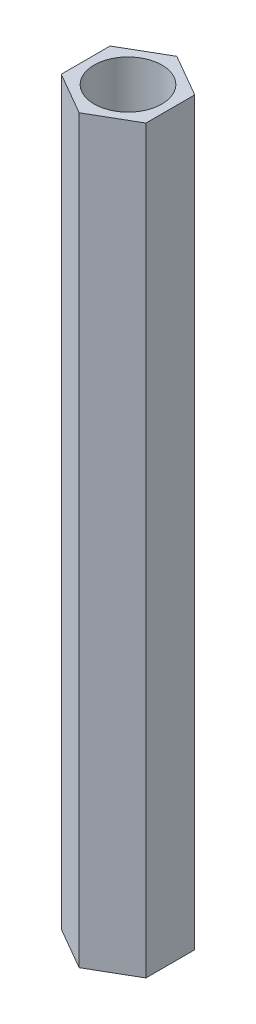
ISO-10303-21;
HEADER;
FILE_DESCRIPTION(('STEP AP214'),'2;1');
FILE_NAME('part.step','',(''),(''),'','','');
FILE_SCHEMA(('AUTOMOTIVE_DESIGN { 1 0 10303 214 1 1 1 1 }'));
ENDSEC;
DATA;
#1=APPLICATION_CONTEXT('core data for automotive mechanical design processes');
#2=APPLICATION_PROTOCOL_DEFINITION('international standard','automotive_design',2000,#1);
#3=PRODUCT_CONTEXT('',#1,'mechanical');
#4=PRODUCT('Part','Part','',(#3));
#5=PRODUCT_RELATED_PRODUCT_CATEGORY('part','',(#4));
#6=PRODUCT_DEFINITION_FORMATION('','',#4);
#7=PRODUCT_DEFINITION_CONTEXT('part definition',#1,'design');
#8=PRODUCT_DEFINITION('design','',#6,#7);
#9=PRODUCT_DEFINITION_SHAPE('','',#8);
#10=(LENGTH_UNIT() NAMED_UNIT(*) SI_UNIT(.MILLI.,.METRE.));
#11=(NAMED_UNIT(*) PLANE_ANGLE_UNIT() SI_UNIT($,.RADIAN.));
#12=(NAMED_UNIT(*) SI_UNIT($,.STERADIAN.) SOLID_ANGLE_UNIT());
#13=UNCERTAINTY_MEASURE_WITH_UNIT(LENGTH_MEASURE(1.E-05),#10,'distance_accuracy_value','');
#14=(GEOMETRIC_REPRESENTATION_CONTEXT(3) GLOBAL_UNCERTAINTY_ASSIGNED_CONTEXT((#13)) GLOBAL_UNIT_ASSIGNED_CONTEXT((#10,
#11,#12)) REPRESENTATION_CONTEXT('',''));
#15=CARTESIAN_POINT('',(0.,0.,0.));
#16=DIRECTION('',(0.,0.,1.));
#17=DIRECTION('',(1.,0.,0.));
#18=AXIS2_PLACEMENT_3D('',#15,#16,#17);
#19=CARTESIAN_POINT('',(0.0007400555675496,35.,2.30940095818183));
#20=DIRECTION('',(-0.500277495165218,0.,-0.865865132587758));
#21=DIRECTION('',(-0.865865132587758,0.,0.500277495165218));
#22=AXIS2_PLACEMENT_3D('',#19,#20,#21);
#23=PLANE('',#22);
#24=DIRECTION('',(0.865865132587758,0.,-0.500277495165218));
#25=VECTOR('',#24,1.);
#26=CARTESIAN_POINT('',(0.0007400555675496,0.,2.30940095818183));
#27=LINE('',#26,#25);
#28=CARTESIAN_POINT('',(0.0007400555675496,0.,2.30940095818183));
#29=VERTEX_POINT('',#28);
#30=CARTESIAN_POINT('',(2.00036992509335,0.,1.15405957216923));
#31=VERTEX_POINT('',#30);
#32=EDGE_CURVE('E128',#29,#31,#27,.T.);
#33=ORIENTED_EDGE('',*,*,#32,.T.);
#34=DIRECTION('',(0.,-1.,0.));
#35=VECTOR('',#34,1.);
#36=CARTESIAN_POINT('',(2.00036992509335,35.,1.15405957216923));
#37=LINE('',#36,#35);
#38=CARTESIAN_POINT('',(2.00036992509335,35.,1.15405957216923));
#39=VERTEX_POINT('',#38);
#40=EDGE_CURVE('E11',#39,#31,#37,.T.);
#41=ORIENTED_EDGE('',*,*,#40,.F.);
#42=DIRECTION('',(0.865865132587758,0.,-0.500277495165218));
#43=VECTOR('',#42,1.);
#44=CARTESIAN_POINT('',(0.0007400555675496,35.,2.30940095818183));
#45=LINE('',#44,#43);
#46=CARTESIAN_POINT('',(0.0007400555675496,35.,2.30940095818183));
#47=VERTEX_POINT('',#46);
#48=EDGE_CURVE('E145',#47,#39,#45,.T.);
#49=ORIENTED_EDGE('',*,*,#48,.F.);
#50=DIRECTION('',(0.,-1.,0.));
#51=VECTOR('',#50,1.);
#52=CARTESIAN_POINT('',(0.0007400555675496,35.,2.30940095818183));
#53=LINE('',#52,#51);
#54=EDGE_CURVE('E124',#47,#29,#53,.T.);
#55=ORIENTED_EDGE('',*,*,#54,.T.);
#56=EDGE_LOOP('',(#33,#41,#49,#55));
#57=FACE_BOUND('',#56,.T.);
#58=ADVANCED_FACE('F39',(#57),#23,.F.);
#59=CARTESIAN_POINT('',(2.00036992509335,35.,1.15405957216923));
#60=DIRECTION('',(-0.999999948654788,0.,0.000320453460846032));
#61=DIRECTION('',(0.000320453460846032,0.,0.999999948654788));
#62=AXIS2_PLACEMENT_3D('',#59,#60,#61);
#63=PLANE('',#62);
#64=DIRECTION('',(-0.000320453460846032,0.,-0.999999948654788));
#65=VECTOR('',#64,1.);
#66=CARTESIAN_POINT('',(2.00036992509335,0.,1.15405957216923));
#67=LINE('',#66,#65);
#68=CARTESIAN_POINT('',(1.99962986952582,0.,-1.1553413860126));
#69=VERTEX_POINT('',#68);
#70=EDGE_CURVE('E132',#31,#69,#67,.T.);
#71=ORIENTED_EDGE('',*,*,#70,.T.);
#72=DIRECTION('',(0.,-1.,0.));
#73=VECTOR('',#72,1.);
#74=CARTESIAN_POINT('',(1.99962986952582,35.,-1.1553413860126));
#75=LINE('',#74,#73);
#76=CARTESIAN_POINT('',(1.99962986952582,35.,-1.1553413860126));
#77=VERTEX_POINT('',#76);
#78=EDGE_CURVE('E48',#77,#69,#75,.T.);
#79=ORIENTED_EDGE('',*,*,#78,.F.);
#80=DIRECTION('',(-0.000320453460846032,0.,-0.999999948654788));
#81=VECTOR('',#80,1.);
#82=CARTESIAN_POINT('',(2.00036992509335,35.,1.15405957216923));
#83=LINE('',#82,#81);
#84=EDGE_CURVE('E93',#39,#77,#83,.T.);
#85=ORIENTED_EDGE('',*,*,#84,.F.);
#86=ORIENTED_EDGE('',*,*,#40,.T.);
#87=EDGE_LOOP('',(#71,#79,#85,#86));
#88=FACE_BOUND('',#87,.T.);
#89=ADVANCED_FACE('F174',(#88),#63,.F.);
#90=CARTESIAN_POINT('',(1.99962986952582,35.,-1.1553413860126));
#91=DIRECTION('',(-0.49972245348957,0.,0.866185586048604));
#92=DIRECTION('',(0.866185586048604,0.,0.49972245348957));
#93=AXIS2_PLACEMENT_3D('',#90,#91,#92);
#94=PLANE('',#93);
#95=DIRECTION('',(-0.866185586048604,0.,-0.49972245348957));
#96=VECTOR('',#95,1.);
#97=CARTESIAN_POINT('',(1.99962986952582,0.,-1.1553413860126));
#98=LINE('',#97,#96);
#99=CARTESIAN_POINT('',(-0.000740055567527786,0.,-2.30940095818181));
#100=VERTEX_POINT('',#99);
#101=EDGE_CURVE('E136',#69,#100,#98,.T.);
#102=ORIENTED_EDGE('',*,*,#101,.T.);
#103=DIRECTION('',(0.,-1.,0.));
#104=VECTOR('',#103,1.);
#105=CARTESIAN_POINT('',(-0.000740055567527786,35.,-2.30940095818181));
#106=LINE('',#105,#104);
#107=CARTESIAN_POINT('',(-0.000740055567527786,35.,-2.30940095818181));
#108=VERTEX_POINT('',#107);
#109=EDGE_CURVE('E117',#108,#100,#106,.T.);
#110=ORIENTED_EDGE('',*,*,#109,.F.);
#111=DIRECTION('',(-0.866185586048604,0.,-0.49972245348957));
#112=VECTOR('',#111,1.);
#113=CARTESIAN_POINT('',(1.99962986952582,35.,-1.1553413860126));
#114=LINE('',#113,#112);
#115=EDGE_CURVE('E106',#77,#108,#114,.T.);
#116=ORIENTED_EDGE('',*,*,#115,.F.);
#117=ORIENTED_EDGE('',*,*,#78,.T.);
#118=EDGE_LOOP('',(#102,#110,#116,#117));
#119=FACE_BOUND('',#118,.T.);
#120=ADVANCED_FACE('F155',(#119),#94,.F.);
#121=CARTESIAN_POINT('',(-0.000740055567527786,35.,-2.30940095818181));
#122=DIRECTION('',(0.500277495165218,0.,0.865865132587758));
#123=DIRECTION('',(0.865865132587758,0.,-0.500277495165218));
#124=AXIS2_PLACEMENT_3D('',#121,#122,#123);
#125=PLANE('',#124);
#126=DIRECTION('',(-0.865865132587758,0.,0.500277495165218));
#127=VECTOR('',#126,1.);
#128=CARTESIAN_POINT('',(-0.000740055567527786,0.,-2.30940095818181));
#129=LINE('',#128,#127);
#130=CARTESIAN_POINT('',(-2.00036992509334,0.,-1.15405957216921));
#131=VERTEX_POINT('',#130);
#132=EDGE_CURVE('E115',#100,#131,#129,.T.);
#133=ORIENTED_EDGE('',*,*,#132,.T.);
#134=DIRECTION('',(0.,-1.,0.));
#135=VECTOR('',#134,1.);
#136=CARTESIAN_POINT('',(-2.00036992509334,35.,-1.15405957216921));
#137=LINE('',#136,#135);
#138=CARTESIAN_POINT('',(-2.00036992509334,35.,-1.15405957216921));
#139=VERTEX_POINT('',#138);
#140=EDGE_CURVE('E112',#139,#131,#137,.T.);
#141=ORIENTED_EDGE('',*,*,#140,.F.);
#142=DIRECTION('',(-0.865865132587758,0.,0.500277495165218));
#143=VECTOR('',#142,1.);
#144=CARTESIAN_POINT('',(-0.000740055567527786,35.,-2.30940095818181));
#145=LINE('',#144,#143);
#146=EDGE_CURVE('E100',#108,#139,#145,.T.);
#147=ORIENTED_EDGE('',*,*,#146,.F.);
#148=ORIENTED_EDGE('',*,*,#109,.T.);
#149=EDGE_LOOP('',(#133,#141,#147,#148));
#150=FACE_BOUND('',#149,.T.);
#151=ADVANCED_FACE('F113',(#150),#125,.F.);
#152=CARTESIAN_POINT('',(-2.00036992509334,35.,-1.15405957216921));
#153=DIRECTION('',(0.999999948654788,0.,-0.000320453460847536));
#154=DIRECTION('',(-0.000320453460847536,0.,-0.999999948654788));
#155=AXIS2_PLACEMENT_3D('',#152,#153,#154);
#156=PLANE('',#155);
#157=DIRECTION('',(0.000320453460847536,0.,0.999999948654788));
#158=VECTOR('',#157,1.);
#159=CARTESIAN_POINT('',(-2.00036992509334,0.,-1.15405957216921));
#160=LINE('',#159,#158);
#161=CARTESIAN_POINT('',(-1.9996298695258,0.,1.1553413860126));
#162=VERTEX_POINT('',#161);
#163=EDGE_CURVE('E79',#131,#162,#160,.T.);
#164=ORIENTED_EDGE('',*,*,#163,.T.);
#165=DIRECTION('',(0.,-1.,0.));
#166=VECTOR('',#165,1.);
#167=CARTESIAN_POINT('',(-1.9996298695258,35.,1.1553413860126));
#168=LINE('',#167,#166);
#169=CARTESIAN_POINT('',(-1.9996298695258,35.,1.1553413860126));
#170=VERTEX_POINT('',#169);
#171=EDGE_CURVE('E118',#170,#162,#168,.T.);
#172=ORIENTED_EDGE('',*,*,#171,.F.);
#173=DIRECTION('',(0.000320453460847536,0.,0.999999948654788));
#174=VECTOR('',#173,1.);
#175=CARTESIAN_POINT('',(-2.00036992509334,35.,-1.15405957216921));
#176=LINE('',#175,#174);
#177=EDGE_CURVE('E104',#139,#170,#176,.T.);
#178=ORIENTED_EDGE('',*,*,#177,.F.);
#179=ORIENTED_EDGE('',*,*,#140,.T.);
#180=EDGE_LOOP('',(#164,#172,#178,#179));
#181=FACE_BOUND('',#180,.T.);
#182=ADVANCED_FACE('F120',(#181),#156,.F.);
#183=CARTESIAN_POINT('',(-1.9996298695258,35.,1.1553413860126));
#184=DIRECTION('',(0.49972245348957,0.,-0.866185586048605));
#185=DIRECTION('',(-0.866185586048605,0.,-0.49972245348957));
#186=AXIS2_PLACEMENT_3D('',#183,#184,#185);
#187=PLANE('',#186);
#188=DIRECTION('',(0.866185586048605,0.,0.49972245348957));
#189=VECTOR('',#188,1.);
#190=CARTESIAN_POINT('',(-1.9996298695258,0.,1.1553413860126));
#191=LINE('',#190,#189);
#192=EDGE_CURVE('E85',#162,#29,#191,.T.);
#193=ORIENTED_EDGE('',*,*,#192,.T.);
#194=ORIENTED_EDGE('',*,*,#54,.F.);
#195=DIRECTION('',(0.866185586048605,0.,0.49972245348957));
#196=VECTOR('',#195,1.);
#197=CARTESIAN_POINT('',(-1.9996298695258,35.,1.1553413860126));
#198=LINE('',#197,#196);
#199=EDGE_CURVE('E56',#170,#47,#198,.T.);
#200=ORIENTED_EDGE('',*,*,#199,.F.);
#201=ORIENTED_EDGE('',*,*,#171,.T.);
#202=EDGE_LOOP('',(#193,#194,#200,#201));
#203=FACE_BOUND('',#202,.T.);
#204=ADVANCED_FACE('F162',(#203),#187,.F.);
#205=CARTESIAN_POINT('',(0.,35.,0.));
#206=DIRECTION('',(0.,1.,0.));
#207=DIRECTION('',(0.,0.,1.));
#208=AXIS2_PLACEMENT_3D('',#205,#206,#207);
#209=PLANE('',#208);
#210=CARTESIAN_POINT('',(0.,35.,0.));
#211=DIRECTION('',(0.,1.,0.));
#212=DIRECTION('',(0.,0.,1.));
#213=AXIS2_PLACEMENT_3D('',#210,#211,#212);
#214=CIRCLE('',#213,1.6);
#215=CARTESIAN_POINT('',(0.,35.,1.6));
#216=VERTEX_POINT('',#215);
#217=EDGE_CURVE('E229',#216,#216,#214,.T.);
#218=ORIENTED_EDGE('',*,*,#217,.F.);
#219=EDGE_LOOP('',(#218));
#220=FACE_BOUND('',#219,.T.);
#221=ORIENTED_EDGE('',*,*,#48,.T.);
#222=ORIENTED_EDGE('',*,*,#84,.T.);
#223=ORIENTED_EDGE('',*,*,#115,.T.);
#224=ORIENTED_EDGE('',*,*,#146,.T.);
#225=ORIENTED_EDGE('',*,*,#177,.T.);
#226=ORIENTED_EDGE('',*,*,#199,.T.);
#227=EDGE_LOOP('',(#221,#222,#223,#224,#225,#226));
#228=FACE_BOUND('',#227,.T.);
#229=ADVANCED_FACE('F102',(#220,#228),#209,.T.);
#230=CARTESIAN_POINT('',(0.,0.,0.));
#231=DIRECTION('',(0.,1.,0.));
#232=DIRECTION('',(0.,0.,1.));
#233=AXIS2_PLACEMENT_3D('',#230,#231,#232);
#234=PLANE('',#233);
#235=CARTESIAN_POINT('',(0.,0.,0.));
#236=DIRECTION('',(0.,1.,0.));
#237=DIRECTION('',(0.,0.,1.));
#238=AXIS2_PLACEMENT_3D('',#235,#236,#237);
#239=CIRCLE('',#238,1.6);
#240=CARTESIAN_POINT('',(0.,0.,1.6));
#241=VERTEX_POINT('',#240);
#242=EDGE_CURVE('E133',#241,#241,#239,.T.);
#243=ORIENTED_EDGE('',*,*,#242,.T.);
#244=EDGE_LOOP('',(#243));
#245=FACE_BOUND('',#244,.T.);
#246=ORIENTED_EDGE('',*,*,#32,.F.);
#247=ORIENTED_EDGE('',*,*,#192,.F.);
#248=ORIENTED_EDGE('',*,*,#163,.F.);
#249=ORIENTED_EDGE('',*,*,#132,.F.);
#250=ORIENTED_EDGE('',*,*,#101,.F.);
#251=ORIENTED_EDGE('',*,*,#70,.F.);
#252=EDGE_LOOP('',(#246,#247,#248,#249,#250,#251));
#253=FACE_BOUND('',#252,.T.);
#254=ADVANCED_FACE('F158',(#245,#253),#234,.F.);
#255=CARTESIAN_POINT('',(0.,0.,0.));
#256=DIRECTION('',(0.,1.,0.));
#257=DIRECTION('',(0.,0.,1.));
#258=AXIS2_PLACEMENT_3D('',#255,#256,#257);
#259=CYLINDRICAL_SURFACE('',#258,1.6);
#260=ORIENTED_EDGE('',*,*,#242,.F.);
#261=EDGE_LOOP('',(#260));
#262=FACE_BOUND('',#261,.T.);
#263=ORIENTED_EDGE('',*,*,#217,.T.);
#264=EDGE_LOOP('',(#263));
#265=FACE_BOUND('',#264,.T.);
#266=ADVANCED_FACE('F211',(#262,#265),#259,.F.);
#267=CLOSED_SHELL('',(#58,#89,#120,#151,#182,#204,#229,#254,#266));
#268=MANIFOLD_SOLID_BREP('B2',#267);
#269=ADVANCED_BREP_SHAPE_REPRESENTATION('',(#18,#268),#14);
#270=SHAPE_DEFINITION_REPRESENTATION(#9,#269);
ENDSEC;
END-ISO-10303-21;
